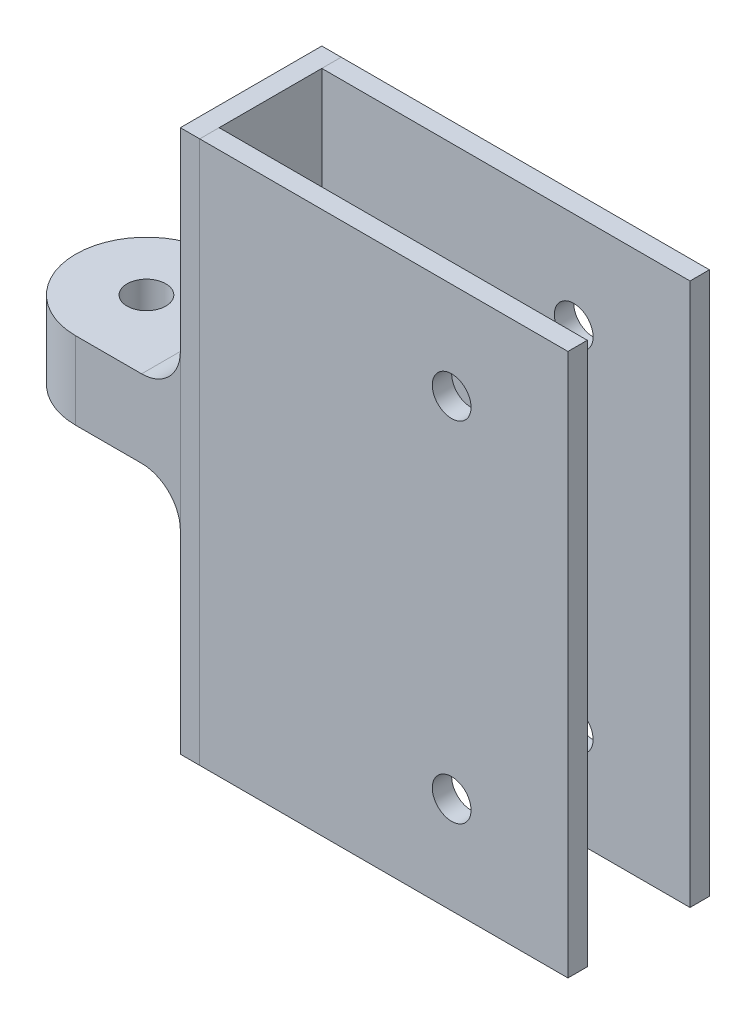
ISO-10303-21;
HEADER;
FILE_DESCRIPTION(('STEP AP214'),'2;1');
FILE_NAME('part.step','',(''),(''),'','','');
FILE_SCHEMA(('AUTOMOTIVE_DESIGN { 1 0 10303 214 1 1 1 1 }'));
ENDSEC;
DATA;
#1=APPLICATION_CONTEXT('core data for automotive mechanical design processes');
#2=APPLICATION_PROTOCOL_DEFINITION('international standard','automotive_design',2000,#1);
#3=PRODUCT_CONTEXT('',#1,'mechanical');
#4=PRODUCT('Part','Part','',(#3));
#5=PRODUCT_RELATED_PRODUCT_CATEGORY('part','',(#4));
#6=PRODUCT_DEFINITION_FORMATION('','',#4);
#7=PRODUCT_DEFINITION_CONTEXT('part definition',#1,'design');
#8=PRODUCT_DEFINITION('design','',#6,#7);
#9=PRODUCT_DEFINITION_SHAPE('','',#8);
#10=(LENGTH_UNIT() NAMED_UNIT(*) SI_UNIT(.MILLI.,.METRE.));
#11=(NAMED_UNIT(*) PLANE_ANGLE_UNIT() SI_UNIT($,.RADIAN.));
#12=(NAMED_UNIT(*) SI_UNIT($,.STERADIAN.) SOLID_ANGLE_UNIT());
#13=UNCERTAINTY_MEASURE_WITH_UNIT(LENGTH_MEASURE(1.E-05),#10,'distance_accuracy_value','');
#14=(GEOMETRIC_REPRESENTATION_CONTEXT(3) GLOBAL_UNCERTAINTY_ASSIGNED_CONTEXT((#13)) GLOBAL_UNIT_ASSIGNED_CONTEXT((#10,
#11,#12)) REPRESENTATION_CONTEXT('',''));
#15=CARTESIAN_POINT('',(0.,0.,0.));
#16=DIRECTION('',(0.,0.,1.));
#17=DIRECTION('',(1.,0.,0.));
#18=AXIS2_PLACEMENT_3D('',#15,#16,#17);
#19=CARTESIAN_POINT('',(5.,-60.01,-5.));
#20=DIRECTION('',(-1.,0.,0.));
#21=DIRECTION('',(0.,0.,1.));
#22=AXIS2_PLACEMENT_3D('',#19,#20,#21);
#23=PLANE('',#22);
#24=DIRECTION('',(0.,0.,-1.));
#25=VECTOR('',#24,1.);
#26=CARTESIAN_POINT('',(5.,-60.,0.));
#27=LINE('',#26,#25);
#28=CARTESIAN_POINT('',(5.,-60.,0.));
#29=VERTEX_POINT('',#28);
#30=CARTESIAN_POINT('',(4.99999999999999,-60.,-5.));
#31=VERTEX_POINT('',#30);
#32=EDGE_CURVE('E202',#29,#31,#27,.T.);
#33=ORIENTED_EDGE('',*,*,#32,.F.);
#34=DIRECTION('',(0.,1.,0.));
#35=VECTOR('',#34,1.);
#36=CARTESIAN_POINT('',(5.,20.,0.));
#37=LINE('',#36,#35);
#38=CARTESIAN_POINT('',(5.,80.,0.));
#39=VERTEX_POINT('',#38);
#40=EDGE_CURVE('E211',#29,#39,#37,.T.);
#41=ORIENTED_EDGE('',*,*,#40,.T.);
#42=DIRECTION('',(0.,0.,1.));
#43=VECTOR('',#42,1.);
#44=CARTESIAN_POINT('',(5.,80.,0.));
#45=LINE('',#44,#43);
#46=CARTESIAN_POINT('',(5.,80.,-5.));
#47=VERTEX_POINT('',#46);
#48=EDGE_CURVE('E208',#47,#39,#45,.T.);
#49=ORIENTED_EDGE('',*,*,#48,.F.);
#50=DIRECTION('',(0.,-1.,0.));
#51=VECTOR('',#50,1.);
#52=CARTESIAN_POINT('',(4.99999999999999,20.,-5.));
#53=LINE('',#52,#51);
#54=EDGE_CURVE('E196',#47,#31,#53,.T.);
#55=ORIENTED_EDGE('',*,*,#54,.T.);
#56=EDGE_LOOP('',(#33,#41,#49,#55));
#57=FACE_BOUND('',#56,.T.);
#58=ADVANCED_FACE('F149',(#57),#23,.T.);
#59=CARTESIAN_POINT('',(0.,20.,0.));
#60=DIRECTION('',(0.,0.,-1.));
#61=DIRECTION('',(-1.,0.,0.));
#62=AXIS2_PLACEMENT_3D('',#59,#60,#61);
#63=PLANE('',#62);
#64=CARTESIAN_POINT('',(70.,-35.,0.));
#65=DIRECTION('',(0.,0.,1.));
#66=DIRECTION('',(1.,0.,0.));
#67=AXIS2_PLACEMENT_3D('',#64,#65,#66);
#68=CIRCLE('',#67,4.99999999999999);
#69=CARTESIAN_POINT('',(75.,-35.,0.));
#70=VERTEX_POINT('',#69);
#71=EDGE_CURVE('E228',#70,#70,#68,.T.);
#72=ORIENTED_EDGE('',*,*,#71,.F.);
#73=EDGE_LOOP('',(#72));
#74=FACE_BOUND('',#73,.T.);
#75=CARTESIAN_POINT('',(70.,55.,0.));
#76=DIRECTION('',(0.,0.,1.));
#77=DIRECTION('',(1.,0.,0.));
#78=AXIS2_PLACEMENT_3D('',#75,#76,#77);
#79=CIRCLE('',#78,4.99999999999999);
#80=CARTESIAN_POINT('',(75.,55.,0.));
#81=VERTEX_POINT('',#80);
#82=EDGE_CURVE('E13',#81,#81,#79,.T.);
#83=ORIENTED_EDGE('',*,*,#82,.F.);
#84=EDGE_LOOP('',(#83));
#85=FACE_BOUND('',#84,.T.);
#86=ORIENTED_EDGE('',*,*,#40,.F.);
#87=DIRECTION('',(-1.,0.,0.));
#88=VECTOR('',#87,1.);
#89=CARTESIAN_POINT('',(0.,-60.,0.));
#90=LINE('',#89,#88);
#91=CARTESIAN_POINT('',(100.,-60.,0.));
#92=VERTEX_POINT('',#91);
#93=EDGE_CURVE('E153',#92,#29,#90,.T.);
#94=ORIENTED_EDGE('',*,*,#93,.F.);
#95=DIRECTION('',(0.,-1.,0.));
#96=VECTOR('',#95,1.);
#97=CARTESIAN_POINT('',(100.,20.,0.));
#98=LINE('',#97,#96);
#99=CARTESIAN_POINT('',(100.,80.,0.));
#100=VERTEX_POINT('',#99);
#101=EDGE_CURVE('E174',#100,#92,#98,.T.);
#102=ORIENTED_EDGE('',*,*,#101,.F.);
#103=DIRECTION('',(1.,0.,0.));
#104=VECTOR('',#103,1.);
#105=CARTESIAN_POINT('',(0.,80.,0.));
#106=LINE('',#105,#104);
#107=EDGE_CURVE('E215',#39,#100,#106,.T.);
#108=ORIENTED_EDGE('',*,*,#107,.F.);
#109=EDGE_LOOP('',(#86,#94,#102,#108));
#110=FACE_BOUND('',#109,.T.);
#111=ADVANCED_FACE('F151',(#74,#85,#110),#63,.F.);
#112=CARTESIAN_POINT('',(0.,80.,0.));
#113=DIRECTION('',(0.,1.,0.));
#114=DIRECTION('',(0.,0.,1.));
#115=AXIS2_PLACEMENT_3D('',#112,#113,#114);
#116=PLANE('',#115);
#117=DIRECTION('',(-1.,0.,0.));
#118=VECTOR('',#117,1.);
#119=CARTESIAN_POINT('',(0.,80.,-5.));
#120=LINE('',#119,#118);
#121=CARTESIAN_POINT('',(100.,80.,-4.99999999999998));
#122=VERTEX_POINT('',#121);
#123=EDGE_CURVE('E220',#122,#47,#120,.T.);
#124=ORIENTED_EDGE('',*,*,#123,.T.);
#125=ORIENTED_EDGE('',*,*,#48,.T.);
#126=ORIENTED_EDGE('',*,*,#107,.T.);
#127=DIRECTION('',(0.,0.,-1.));
#128=VECTOR('',#127,1.);
#129=CARTESIAN_POINT('',(100.,80.,-2.7755575615629E-13));
#130=LINE('',#129,#128);
#131=EDGE_CURVE('E216',#100,#122,#130,.T.);
#132=ORIENTED_EDGE('',*,*,#131,.T.);
#133=EDGE_LOOP('',(#124,#125,#126,#132));
#134=FACE_BOUND('',#133,.T.);
#135=ADVANCED_FACE('F230',(#134),#116,.T.);
#136=CARTESIAN_POINT('',(0.,-60.,0.));
#137=DIRECTION('',(0.,-1.,0.));
#138=DIRECTION('',(0.,0.,-1.));
#139=AXIS2_PLACEMENT_3D('',#136,#137,#138);
#140=PLANE('',#139);
#141=ORIENTED_EDGE('',*,*,#93,.T.);
#142=ORIENTED_EDGE('',*,*,#32,.T.);
#143=DIRECTION('',(1.,0.,0.));
#144=VECTOR('',#143,1.);
#145=CARTESIAN_POINT('',(0.,-60.,-5.));
#146=LINE('',#145,#144);
#147=CARTESIAN_POINT('',(100.,-60.,-4.99999999999998));
#148=VERTEX_POINT('',#147);
#149=EDGE_CURVE('E192',#31,#148,#146,.T.);
#150=ORIENTED_EDGE('',*,*,#149,.T.);
#151=DIRECTION('',(0.,0.,1.));
#152=VECTOR('',#151,1.);
#153=CARTESIAN_POINT('',(100.,-60.,-2.7755575615629E-13));
#154=LINE('',#153,#152);
#155=EDGE_CURVE('E199',#148,#92,#154,.T.);
#156=ORIENTED_EDGE('',*,*,#155,.T.);
#157=EDGE_LOOP('',(#141,#142,#150,#156));
#158=FACE_BOUND('',#157,.T.);
#159=ADVANCED_FACE('F203',(#158),#140,.T.);
#160=CARTESIAN_POINT('',(100.,20.,-2.7755575615629E-13));
#161=DIRECTION('',(-1.,0.,0.));
#162=DIRECTION('',(0.,0.,1.));
#163=AXIS2_PLACEMENT_3D('',#160,#161,#162);
#164=PLANE('',#163);
#165=ORIENTED_EDGE('',*,*,#101,.T.);
#166=ORIENTED_EDGE('',*,*,#155,.F.);
#167=DIRECTION('',(0.,-1.,0.));
#168=VECTOR('',#167,1.);
#169=CARTESIAN_POINT('',(100.,20.,-4.99999999999998));
#170=LINE('',#169,#168);
#171=EDGE_CURVE('E166',#122,#148,#170,.T.);
#172=ORIENTED_EDGE('',*,*,#171,.F.);
#173=ORIENTED_EDGE('',*,*,#131,.F.);
#174=EDGE_LOOP('',(#165,#166,#172,#173));
#175=FACE_BOUND('',#174,.T.);
#176=ADVANCED_FACE('F233',(#175),#164,.F.);
#177=CARTESIAN_POINT('',(0.,20.,-5.));
#178=DIRECTION('',(0.,0.,-1.));
#179=DIRECTION('',(-1.,0.,0.));
#180=AXIS2_PLACEMENT_3D('',#177,#178,#179);
#181=PLANE('',#180);
#182=CARTESIAN_POINT('',(70.,55.,-4.99999999999999));
#183=DIRECTION('',(0.,0.,-1.));
#184=DIRECTION('',(-1.,0.,0.));
#185=AXIS2_PLACEMENT_3D('',#182,#183,#184);
#186=CIRCLE('',#185,4.99999999999999);
#187=CARTESIAN_POINT('',(65.,55.,-4.99999999999999));
#188=VERTEX_POINT('',#187);
#189=EDGE_CURVE('E158',#188,#188,#186,.T.);
#190=ORIENTED_EDGE('',*,*,#189,.F.);
#191=EDGE_LOOP('',(#190));
#192=FACE_BOUND('',#191,.T.);
#193=CARTESIAN_POINT('',(70.,-35.,-4.99999999999999));
#194=DIRECTION('',(0.,0.,-1.));
#195=DIRECTION('',(-1.,0.,0.));
#196=AXIS2_PLACEMENT_3D('',#193,#194,#195);
#197=CIRCLE('',#196,4.99999999999999);
#198=CARTESIAN_POINT('',(65.,-35.,-4.99999999999999));
#199=VERTEX_POINT('',#198);
#200=EDGE_CURVE('E198',#199,#199,#197,.T.);
#201=ORIENTED_EDGE('',*,*,#200,.F.);
#202=EDGE_LOOP('',(#201));
#203=FACE_BOUND('',#202,.T.);
#204=ORIENTED_EDGE('',*,*,#171,.T.);
#205=ORIENTED_EDGE('',*,*,#149,.F.);
#206=ORIENTED_EDGE('',*,*,#54,.F.);
#207=ORIENTED_EDGE('',*,*,#123,.F.);
#208=EDGE_LOOP('',(#204,#205,#206,#207));
#209=FACE_BOUND('',#208,.T.);
#210=ADVANCED_FACE('F194',(#192,#203,#209),#181,.T.);
#211=CARTESIAN_POINT('',(70.,-35.,0.));
#212=DIRECTION('',(0.,0.,1.));
#213=DIRECTION('',(1.,0.,0.));
#214=AXIS2_PLACEMENT_3D('',#211,#212,#213);
#215=CYLINDRICAL_SURFACE('',#214,4.99999999999999);
#216=ORIENTED_EDGE('',*,*,#200,.T.);
#217=EDGE_LOOP('',(#216));
#218=FACE_BOUND('',#217,.T.);
#219=ORIENTED_EDGE('',*,*,#71,.T.);
#220=EDGE_LOOP('',(#219));
#221=FACE_BOUND('',#220,.T.);
#222=ADVANCED_FACE('F243',(#218,#221),#215,.F.);
#223=CARTESIAN_POINT('',(70.,55.,0.));
#224=DIRECTION('',(0.,0.,1.));
#225=DIRECTION('',(1.,0.,0.));
#226=AXIS2_PLACEMENT_3D('',#223,#224,#225);
#227=CYLINDRICAL_SURFACE('',#226,4.99999999999999);
#228=ORIENTED_EDGE('',*,*,#189,.T.);
#229=EDGE_LOOP('',(#228));
#230=FACE_BOUND('',#229,.T.);
#231=ORIENTED_EDGE('',*,*,#82,.T.);
#232=EDGE_LOOP('',(#231));
#233=FACE_BOUND('',#232,.T.);
#234=ADVANCED_FACE('F238',(#230,#233),#227,.F.);
#235=CLOSED_SHELL('',(#58,#111,#135,#159,#176,#210,#222,#234));
#236=MANIFOLD_SOLID_BREP('B2',#235);
#237=CARTESIAN_POINT('',(0.,-60.01,-36.5));
#238=DIRECTION('',(-1.,0.,0.));
#239=DIRECTION('',(0.,0.,1.));
#240=AXIS2_PLACEMENT_3D('',#237,#238,#239);
#241=PLANE('',#240);
#242=DIRECTION('',(0.,0.,1.));
#243=VECTOR('',#242,1.);
#244=CARTESIAN_POINT('',(0.,-10.,0.));
#245=LINE('',#244,#243);
#246=CARTESIAN_POINT('',(0.,-10.,0.));
#247=VERTEX_POINT('',#246);
#248=CARTESIAN_POINT('',(0.,-10.,-36.5));
#249=VERTEX_POINT('',#248);
#250=EDGE_CURVE('E414',#247,#249,#245,.F.);
#251=ORIENTED_EDGE('',*,*,#250,.T.);
#252=DIRECTION('',(0.,1.,0.));
#253=VECTOR('',#252,1.);
#254=CARTESIAN_POINT('',(0.,20.,-36.5));
#255=LINE('',#254,#253);
#256=CARTESIAN_POINT('',(0.,30.,-36.5));
#257=VERTEX_POINT('',#256);
#258=EDGE_CURVE('E470',#249,#257,#255,.T.);
#259=ORIENTED_EDGE('',*,*,#258,.T.);
#260=DIRECTION('',(0.,0.,-1.));
#261=VECTOR('',#260,1.);
#262=CARTESIAN_POINT('',(0.,30.,0.));
#263=LINE('',#262,#261);
#264=CARTESIAN_POINT('',(0.,30.,0.));
#265=VERTEX_POINT('',#264);
#266=EDGE_CURVE('E477',#257,#265,#263,.F.);
#267=ORIENTED_EDGE('',*,*,#266,.T.);
#268=DIRECTION('',(0.,1.,0.));
#269=VECTOR('',#268,1.);
#270=CARTESIAN_POINT('',(0.,20.,0.));
#271=LINE('',#270,#269);
#272=EDGE_CURVE('E476',#247,#265,#271,.T.);
#273=ORIENTED_EDGE('',*,*,#272,.F.);
#274=EDGE_LOOP('',(#251,#259,#267,#273));
#275=FACE_BOUND('',#274,.T.);
#276=ADVANCED_FACE('F410',(#275),#241,.F.);
#277=CARTESIAN_POINT('',(-27.,20.,-18.25));
#278=DIRECTION('',(0.,1.,0.));
#279=DIRECTION('',(0.,0.,1.));
#280=AXIS2_PLACEMENT_3D('',#277,#278,#279);
#281=CYLINDRICAL_SURFACE('',#280,5.);
#282=CARTESIAN_POINT('',(-27.,0.,-18.25));
#283=DIRECTION('',(0.,1.,0.));
#284=DIRECTION('',(0.,0.,1.));
#285=AXIS2_PLACEMENT_3D('',#282,#283,#284);
#286=CIRCLE('',#285,5.);
#287=CARTESIAN_POINT('',(-27.,0.,-13.25));
#288=VERTEX_POINT('',#287);
#289=EDGE_CURVE('E420',#288,#288,#286,.T.);
#290=ORIENTED_EDGE('',*,*,#289,.F.);
#291=EDGE_LOOP('',(#290));
#292=FACE_BOUND('',#291,.T.);
#293=CARTESIAN_POINT('',(-27.,20.,-18.25));
#294=DIRECTION('',(0.,1.,0.));
#295=DIRECTION('',(0.,0.,1.));
#296=AXIS2_PLACEMENT_3D('',#293,#294,#295);
#297=CIRCLE('',#296,5.);
#298=CARTESIAN_POINT('',(-27.,20.,-13.25));
#299=VERTEX_POINT('',#298);
#300=EDGE_CURVE('E147',#299,#299,#297,.T.);
#301=ORIENTED_EDGE('',*,*,#300,.T.);
#302=EDGE_LOOP('',(#301));
#303=FACE_BOUND('',#302,.T.);
#304=ADVANCED_FACE('F536',(#292,#303),#281,.F.);
#305=CARTESIAN_POINT('',(-27.,20.,-18.25));
#306=DIRECTION('',(0.,-1.,0.));
#307=DIRECTION('',(0.,0.,-1.));
#308=AXIS2_PLACEMENT_3D('',#305,#306,#307);
#309=CYLINDRICAL_SURFACE('',#308,18.25);
#310=CARTESIAN_POINT('',(-27.,0.,-18.25));
#311=DIRECTION('',(0.,1.,0.));
#312=DIRECTION('',(0.,0.,1.));
#313=AXIS2_PLACEMENT_3D('',#310,#311,#312);
#314=CIRCLE('',#313,18.25);
#315=CARTESIAN_POINT('',(-27.,0.,-36.5));
#316=VERTEX_POINT('',#315);
#317=CARTESIAN_POINT('',(-27.,0.,0.));
#318=VERTEX_POINT('',#317);
#319=EDGE_CURVE('E505',#316,#318,#314,.T.);
#320=ORIENTED_EDGE('',*,*,#319,.T.);
#321=DIRECTION('',(0.,-1.,0.));
#322=VECTOR('',#321,1.);
#323=CARTESIAN_POINT('',(-27.,20.,0.));
#324=LINE('',#323,#322);
#325=CARTESIAN_POINT('',(-27.,20.,0.));
#326=VERTEX_POINT('',#325);
#327=EDGE_CURVE('E498',#326,#318,#324,.T.);
#328=ORIENTED_EDGE('',*,*,#327,.F.);
#329=CARTESIAN_POINT('',(-27.,20.,-18.25));
#330=DIRECTION('',(0.,1.,0.));
#331=DIRECTION('',(0.,0.,1.));
#332=AXIS2_PLACEMENT_3D('',#329,#330,#331);
#333=CIRCLE('',#332,18.25);
#334=CARTESIAN_POINT('',(-27.,20.,-36.5));
#335=VERTEX_POINT('',#334);
#336=EDGE_CURVE('E439',#335,#326,#333,.T.);
#337=ORIENTED_EDGE('',*,*,#336,.F.);
#338=DIRECTION('',(0.,-1.,0.));
#339=VECTOR('',#338,1.);
#340=CARTESIAN_POINT('',(-27.,20.,-36.5));
#341=LINE('',#340,#339);
#342=EDGE_CURVE('E429',#335,#316,#341,.T.);
#343=ORIENTED_EDGE('',*,*,#342,.T.);
#344=EDGE_LOOP('',(#320,#328,#337,#343));
#345=FACE_BOUND('',#344,.T.);
#346=ADVANCED_FACE('F523',(#345),#309,.T.);
#347=CARTESIAN_POINT('',(0.,0.,0.));
#348=DIRECTION('',(0.,1.,0.));
#349=DIRECTION('',(0.,0.,1.));
#350=AXIS2_PLACEMENT_3D('',#347,#348,#349);
#351=PLANE('',#350);
#352=ORIENTED_EDGE('',*,*,#289,.T.);
#353=EDGE_LOOP('',(#352));
#354=FACE_BOUND('',#353,.T.);
#355=DIRECTION('',(1.,0.,0.));
#356=VECTOR('',#355,1.);
#357=CARTESIAN_POINT('',(0.,0.,-36.5));
#358=LINE('',#357,#356);
#359=CARTESIAN_POINT('',(-10.,0.,-36.5));
#360=VERTEX_POINT('',#359);
#361=EDGE_CURVE('E508',#316,#360,#358,.T.);
#362=ORIENTED_EDGE('',*,*,#361,.T.);
#363=DIRECTION('',(0.,0.,1.));
#364=VECTOR('',#363,1.);
#365=CARTESIAN_POINT('',(-10.,0.,0.));
#366=LINE('',#365,#364);
#367=CARTESIAN_POINT('',(-10.,0.,0.));
#368=VERTEX_POINT('',#367);
#369=EDGE_CURVE('E485',#360,#368,#366,.T.);
#370=ORIENTED_EDGE('',*,*,#369,.T.);
#371=DIRECTION('',(1.,0.,0.));
#372=VECTOR('',#371,1.);
#373=CARTESIAN_POINT('',(0.,0.,0.));
#374=LINE('',#373,#372);
#375=EDGE_CURVE('E502',#318,#368,#374,.T.);
#376=ORIENTED_EDGE('',*,*,#375,.F.);
#377=ORIENTED_EDGE('',*,*,#319,.F.);
#378=EDGE_LOOP('',(#362,#370,#376,#377));
#379=FACE_BOUND('',#378,.T.);
#380=ADVANCED_FACE('F526',(#354,#379),#351,.F.);
#381=CARTESIAN_POINT('',(0.,20.,0.));
#382=DIRECTION('',(0.,1.,0.));
#383=DIRECTION('',(0.,0.,1.));
#384=AXIS2_PLACEMENT_3D('',#381,#382,#383);
#385=PLANE('',#384);
#386=ORIENTED_EDGE('',*,*,#300,.F.);
#387=EDGE_LOOP('',(#386));
#388=FACE_BOUND('',#387,.T.);
#389=DIRECTION('',(1.,0.,0.));
#390=VECTOR('',#389,1.);
#391=CARTESIAN_POINT('',(0.,20.,0.));
#392=LINE('',#391,#390);
#393=CARTESIAN_POINT('',(-10.,20.,0.));
#394=VERTEX_POINT('',#393);
#395=EDGE_CURVE('E501',#326,#394,#392,.T.);
#396=ORIENTED_EDGE('',*,*,#395,.T.);
#397=DIRECTION('',(0.,0.,-1.));
#398=VECTOR('',#397,1.);
#399=CARTESIAN_POINT('',(-10.,20.,-36.5));
#400=LINE('',#399,#398);
#401=CARTESIAN_POINT('',(-10.,20.,-36.5));
#402=VERTEX_POINT('',#401);
#403=EDGE_CURVE('E488',#394,#402,#400,.T.);
#404=ORIENTED_EDGE('',*,*,#403,.T.);
#405=DIRECTION('',(1.,0.,0.));
#406=VECTOR('',#405,1.);
#407=CARTESIAN_POINT('',(0.,20.,-36.5));
#408=LINE('',#407,#406);
#409=EDGE_CURVE('E506',#335,#402,#408,.T.);
#410=ORIENTED_EDGE('',*,*,#409,.F.);
#411=ORIENTED_EDGE('',*,*,#336,.T.);
#412=EDGE_LOOP('',(#396,#404,#410,#411));
#413=FACE_BOUND('',#412,.T.);
#414=ADVANCED_FACE('F522',(#388,#413),#385,.T.);
#415=CARTESIAN_POINT('',(0.,20.,-36.5));
#416=DIRECTION('',(0.,0.,-1.));
#417=DIRECTION('',(-1.,0.,0.));
#418=AXIS2_PLACEMENT_3D('',#415,#416,#417);
#419=PLANE('',#418);
#420=ORIENTED_EDGE('',*,*,#258,.F.);
#421=CARTESIAN_POINT('',(-10.,-10.,-36.5));
#422=DIRECTION('',(0.,0.,-1.));
#423=DIRECTION('',(-1.,0.,0.));
#424=AXIS2_PLACEMENT_3D('',#421,#422,#423);
#425=CIRCLE('',#424,10.);
#426=EDGE_CURVE('E447',#249,#360,#425,.F.);
#427=ORIENTED_EDGE('',*,*,#426,.T.);
#428=ORIENTED_EDGE('',*,*,#361,.F.);
#429=ORIENTED_EDGE('',*,*,#342,.F.);
#430=ORIENTED_EDGE('',*,*,#409,.T.);
#431=CARTESIAN_POINT('',(-10.,30.,-36.5));
#432=DIRECTION('',(0.,0.,-1.));
#433=DIRECTION('',(-1.,0.,0.));
#434=AXIS2_PLACEMENT_3D('',#431,#432,#433);
#435=CIRCLE('',#434,10.);
#436=EDGE_CURVE('E473',#402,#257,#435,.F.);
#437=ORIENTED_EDGE('',*,*,#436,.T.);
#438=EDGE_LOOP('',(#420,#427,#428,#429,#430,#437));
#439=FACE_BOUND('',#438,.T.);
#440=ADVANCED_FACE('F412',(#439),#419,.T.);
#441=CARTESIAN_POINT('',(0.,20.,0.));
#442=DIRECTION('',(0.,0.,-1.));
#443=DIRECTION('',(-1.,0.,0.));
#444=AXIS2_PLACEMENT_3D('',#441,#442,#443);
#445=PLANE('',#444);
#446=CARTESIAN_POINT('',(-10.,-10.,0.));
#447=DIRECTION('',(0.,0.,-1.));
#448=DIRECTION('',(-1.,0.,0.));
#449=AXIS2_PLACEMENT_3D('',#446,#447,#448);
#450=CIRCLE('',#449,10.);
#451=EDGE_CURVE('E486',#368,#247,#450,.T.);
#452=ORIENTED_EDGE('',*,*,#451,.T.);
#453=ORIENTED_EDGE('',*,*,#272,.T.);
#454=CARTESIAN_POINT('',(-10.,30.,0.));
#455=DIRECTION('',(0.,0.,-1.));
#456=DIRECTION('',(-1.,0.,0.));
#457=AXIS2_PLACEMENT_3D('',#454,#455,#456);
#458=CIRCLE('',#457,10.);
#459=EDGE_CURVE('E490',#265,#394,#458,.T.);
#460=ORIENTED_EDGE('',*,*,#459,.T.);
#461=ORIENTED_EDGE('',*,*,#395,.F.);
#462=ORIENTED_EDGE('',*,*,#327,.T.);
#463=ORIENTED_EDGE('',*,*,#375,.T.);
#464=EDGE_LOOP('',(#452,#453,#460,#461,#462,#463));
#465=FACE_BOUND('',#464,.T.);
#466=ADVANCED_FACE('F521',(#465),#445,.F.);
#467=CARTESIAN_POINT('',(-10.,30.,0.));
#468=DIRECTION('',(0.,0.,1.));
#469=DIRECTION('',(1.,0.,0.));
#470=AXIS2_PLACEMENT_3D('',#467,#468,#469);
#471=CYLINDRICAL_SURFACE('',#470,10.);
#472=ORIENTED_EDGE('',*,*,#459,.F.);
#473=ORIENTED_EDGE('',*,*,#266,.F.);
#474=ORIENTED_EDGE('',*,*,#436,.F.);
#475=ORIENTED_EDGE('',*,*,#403,.F.);
#476=EDGE_LOOP('',(#472,#473,#474,#475));
#477=FACE_BOUND('',#476,.T.);
#478=ADVANCED_FACE('F518',(#477),#471,.F.);
#479=CARTESIAN_POINT('',(-10.,-10.,0.));
#480=DIRECTION('',(0.,0.,1.));
#481=DIRECTION('',(1.,0.,0.));
#482=AXIS2_PLACEMENT_3D('',#479,#480,#481);
#483=CYLINDRICAL_SURFACE('',#482,10.);
#484=ORIENTED_EDGE('',*,*,#426,.F.);
#485=ORIENTED_EDGE('',*,*,#250,.F.);
#486=ORIENTED_EDGE('',*,*,#451,.F.);
#487=ORIENTED_EDGE('',*,*,#369,.F.);
#488=EDGE_LOOP('',(#484,#485,#486,#487));
#489=FACE_BOUND('',#488,.T.);
#490=ADVANCED_FACE('F483',(#489),#483,.F.);
#491=CLOSED_SHELL('',(#276,#304,#346,#380,#414,#440,#466,#478,#490));
#492=MANIFOLD_SOLID_BREP('B7',#491);
#493=CARTESIAN_POINT('',(5.,-60.01,-31.5));
#494=DIRECTION('',(1.,0.,0.));
#495=DIRECTION('',(0.,0.,-1.));
#496=AXIS2_PLACEMENT_3D('',#493,#494,#495);
#497=PLANE('',#496);
#498=DIRECTION('',(0.,0.,1.));
#499=VECTOR('',#498,1.);
#500=CARTESIAN_POINT('',(4.99999999999995,-60.,0.));
#501=LINE('',#500,#499);
#502=CARTESIAN_POINT('',(5.,-60.,-36.5));
#503=VERTEX_POINT('',#502);
#504=CARTESIAN_POINT('',(4.99999999999999,-60.,-31.5));
#505=VERTEX_POINT('',#504);
#506=EDGE_CURVE('E743',#503,#505,#501,.T.);
#507=ORIENTED_EDGE('',*,*,#506,.T.);
#508=DIRECTION('',(0.,-1.,0.));
#509=VECTOR('',#508,1.);
#510=CARTESIAN_POINT('',(4.99999999999999,20.,-31.5));
#511=LINE('',#510,#509);
#512=CARTESIAN_POINT('',(5.,80.,-31.5));
#513=VERTEX_POINT('',#512);
#514=EDGE_CURVE('E771',#513,#505,#511,.T.);
#515=ORIENTED_EDGE('',*,*,#514,.F.);
#516=DIRECTION('',(0.,0.,-1.));
#517=VECTOR('',#516,1.);
#518=CARTESIAN_POINT('',(4.99999999999995,80.,0.));
#519=LINE('',#518,#517);
#520=CARTESIAN_POINT('',(5.,80.,-36.5));
#521=VERTEX_POINT('',#520);
#522=EDGE_CURVE('E745',#513,#521,#519,.T.);
#523=ORIENTED_EDGE('',*,*,#522,.T.);
#524=DIRECTION('',(0.,-1.,0.));
#525=VECTOR('',#524,1.);
#526=CARTESIAN_POINT('',(5.,20.,-36.5));
#527=LINE('',#526,#525);
#528=EDGE_CURVE('E741',#521,#503,#527,.T.);
#529=ORIENTED_EDGE('',*,*,#528,.T.);
#530=EDGE_LOOP('',(#507,#515,#523,#529));
#531=FACE_BOUND('',#530,.T.);
#532=ADVANCED_FACE('F697',(#531),#497,.F.);
#533=CARTESIAN_POINT('',(70.,-35.,0.));
#534=DIRECTION('',(0.,0.,1.));
#535=DIRECTION('',(1.,0.,0.));
#536=AXIS2_PLACEMENT_3D('',#533,#534,#535);
#537=CYLINDRICAL_SURFACE('',#536,4.99999999999999);
#538=CARTESIAN_POINT('',(70.,-35.,-36.5));
#539=DIRECTION('',(0.,0.,1.));
#540=DIRECTION('',(1.,0.,0.));
#541=AXIS2_PLACEMENT_3D('',#538,#539,#540);
#542=CIRCLE('',#541,4.99999999999999);
#543=CARTESIAN_POINT('',(75.,-35.,-36.5));
#544=VERTEX_POINT('',#543);
#545=EDGE_CURVE('E760',#544,#544,#542,.T.);
#546=ORIENTED_EDGE('',*,*,#545,.F.);
#547=EDGE_LOOP('',(#546));
#548=FACE_BOUND('',#547,.T.);
#549=CARTESIAN_POINT('',(70.,-35.,-31.5));
#550=DIRECTION('',(0.,0.,-1.));
#551=DIRECTION('',(-1.,0.,0.));
#552=AXIS2_PLACEMENT_3D('',#549,#550,#551);
#553=CIRCLE('',#552,4.99999999999999);
#554=CARTESIAN_POINT('',(65.,-35.,-31.5));
#555=VERTEX_POINT('',#554);
#556=EDGE_CURVE('E757',#555,#555,#553,.T.);
#557=ORIENTED_EDGE('',*,*,#556,.F.);
#558=EDGE_LOOP('',(#557));
#559=FACE_BOUND('',#558,.T.);
#560=ADVANCED_FACE('F795',(#548,#559),#537,.F.);
#561=CARTESIAN_POINT('',(70.,55.,0.));
#562=DIRECTION('',(0.,0.,1.));
#563=DIRECTION('',(1.,0.,0.));
#564=AXIS2_PLACEMENT_3D('',#561,#562,#563);
#565=CYLINDRICAL_SURFACE('',#564,4.99999999999999);
#566=CARTESIAN_POINT('',(70.,55.,-36.5));
#567=DIRECTION('',(0.,0.,1.));
#568=DIRECTION('',(1.,0.,0.));
#569=AXIS2_PLACEMENT_3D('',#566,#567,#568);
#570=CIRCLE('',#569,4.99999999999999);
#571=CARTESIAN_POINT('',(75.,55.,-36.5));
#572=VERTEX_POINT('',#571);
#573=EDGE_CURVE('E408',#572,#572,#570,.T.);
#574=ORIENTED_EDGE('',*,*,#573,.F.);
#575=EDGE_LOOP('',(#574));
#576=FACE_BOUND('',#575,.T.);
#577=CARTESIAN_POINT('',(70.,55.,-31.5));
#578=DIRECTION('',(0.,0.,-1.));
#579=DIRECTION('',(-1.,0.,0.));
#580=AXIS2_PLACEMENT_3D('',#577,#578,#579);
#581=CIRCLE('',#580,4.99999999999999);
#582=CARTESIAN_POINT('',(65.,55.,-31.5));
#583=VERTEX_POINT('',#582);
#584=EDGE_CURVE('E706',#583,#583,#581,.T.);
#585=ORIENTED_EDGE('',*,*,#584,.F.);
#586=EDGE_LOOP('',(#585));
#587=FACE_BOUND('',#586,.T.);
#588=ADVANCED_FACE('F699',(#576,#587),#565,.F.);
#589=CARTESIAN_POINT('',(0.,20.,-31.5));
#590=DIRECTION('',(0.,0.,-1.));
#591=DIRECTION('',(-1.,0.,0.));
#592=AXIS2_PLACEMENT_3D('',#589,#590,#591);
#593=PLANE('',#592);
#594=ORIENTED_EDGE('',*,*,#584,.T.);
#595=EDGE_LOOP('',(#594));
#596=FACE_BOUND('',#595,.T.);
#597=ORIENTED_EDGE('',*,*,#556,.T.);
#598=EDGE_LOOP('',(#597));
#599=FACE_BOUND('',#598,.T.);
#600=ORIENTED_EDGE('',*,*,#514,.T.);
#601=DIRECTION('',(-1.,0.,0.));
#602=VECTOR('',#601,1.);
#603=CARTESIAN_POINT('',(0.,-60.,-31.5));
#604=LINE('',#603,#602);
#605=CARTESIAN_POINT('',(100.,-60.,-31.5));
#606=VERTEX_POINT('',#605);
#607=EDGE_CURVE('E753',#606,#505,#604,.T.);
#608=ORIENTED_EDGE('',*,*,#607,.F.);
#609=DIRECTION('',(0.,-1.,0.));
#610=VECTOR('',#609,1.);
#611=CARTESIAN_POINT('',(100.,20.,-31.5));
#612=LINE('',#611,#610);
#613=CARTESIAN_POINT('',(100.,80.,-31.5));
#614=VERTEX_POINT('',#613);
#615=EDGE_CURVE('E721',#614,#606,#612,.T.);
#616=ORIENTED_EDGE('',*,*,#615,.F.);
#617=DIRECTION('',(1.,0.,0.));
#618=VECTOR('',#617,1.);
#619=CARTESIAN_POINT('',(0.,80.,-31.5));
#620=LINE('',#619,#618);
#621=EDGE_CURVE('E773',#513,#614,#620,.T.);
#622=ORIENTED_EDGE('',*,*,#621,.F.);
#623=EDGE_LOOP('',(#600,#608,#616,#622));
#624=FACE_BOUND('',#623,.T.);
#625=ADVANCED_FACE('F785',(#596,#599,#624),#593,.F.);
#626=CARTESIAN_POINT('',(99.9999999999999,20.,2.77555756156289E-13));
#627=DIRECTION('',(1.,0.,0.));
#628=DIRECTION('',(0.,0.,-1.));
#629=AXIS2_PLACEMENT_3D('',#626,#627,#628);
#630=PLANE('',#629);
#631=ORIENTED_EDGE('',*,*,#615,.T.);
#632=DIRECTION('',(0.,0.,1.));
#633=VECTOR('',#632,1.);
#634=CARTESIAN_POINT('',(99.9999999999999,-60.,2.77555756156289E-13));
#635=LINE('',#634,#633);
#636=CARTESIAN_POINT('',(100.,-60.,-36.5));
#637=VERTEX_POINT('',#636);
#638=EDGE_CURVE('E758',#637,#606,#635,.T.);
#639=ORIENTED_EDGE('',*,*,#638,.F.);
#640=DIRECTION('',(0.,-1.,0.));
#641=VECTOR('',#640,1.);
#642=CARTESIAN_POINT('',(100.,20.,-36.5));
#643=LINE('',#642,#641);
#644=CARTESIAN_POINT('',(100.,80.,-36.5));
#645=VERTEX_POINT('',#644);
#646=EDGE_CURVE('E749',#645,#637,#643,.T.);
#647=ORIENTED_EDGE('',*,*,#646,.F.);
#648=DIRECTION('',(0.,0.,-1.));
#649=VECTOR('',#648,1.);
#650=CARTESIAN_POINT('',(99.9999999999999,80.,2.77555756156289E-13));
#651=LINE('',#650,#649);
#652=EDGE_CURVE('E777',#614,#645,#651,.T.);
#653=ORIENTED_EDGE('',*,*,#652,.F.);
#654=EDGE_LOOP('',(#631,#639,#647,#653));
#655=FACE_BOUND('',#654,.T.);
#656=ADVANCED_FACE('F783',(#655),#630,.T.);
#657=CARTESIAN_POINT('',(0.,20.,-36.5));
#658=DIRECTION('',(0.,0.,-1.));
#659=DIRECTION('',(-1.,0.,0.));
#660=AXIS2_PLACEMENT_3D('',#657,#658,#659);
#661=PLANE('',#660);
#662=ORIENTED_EDGE('',*,*,#528,.F.);
#663=DIRECTION('',(-1.,0.,0.));
#664=VECTOR('',#663,1.);
#665=CARTESIAN_POINT('',(0.,80.,-36.5));
#666=LINE('',#665,#664);
#667=EDGE_CURVE('E763',#645,#521,#666,.T.);
#668=ORIENTED_EDGE('',*,*,#667,.F.);
#669=ORIENTED_EDGE('',*,*,#646,.T.);
#670=DIRECTION('',(1.,0.,0.));
#671=VECTOR('',#670,1.);
#672=CARTESIAN_POINT('',(0.,-60.,-36.5));
#673=LINE('',#672,#671);
#674=EDGE_CURVE('E701',#503,#637,#673,.T.);
#675=ORIENTED_EDGE('',*,*,#674,.F.);
#676=EDGE_LOOP('',(#662,#668,#669,#675));
#677=FACE_BOUND('',#676,.T.);
#678=ORIENTED_EDGE('',*,*,#573,.T.);
#679=EDGE_LOOP('',(#678));
#680=FACE_BOUND('',#679,.T.);
#681=ORIENTED_EDGE('',*,*,#545,.T.);
#682=EDGE_LOOP('',(#681));
#683=FACE_BOUND('',#682,.T.);
#684=ADVANCED_FACE('F755',(#677,#680,#683),#661,.T.);
#685=CARTESIAN_POINT('',(0.,-60.,0.));
#686=DIRECTION('',(0.,-1.,0.));
#687=DIRECTION('',(0.,0.,-1.));
#688=AXIS2_PLACEMENT_3D('',#685,#686,#687);
#689=PLANE('',#688);
#690=ORIENTED_EDGE('',*,*,#506,.F.);
#691=ORIENTED_EDGE('',*,*,#674,.T.);
#692=ORIENTED_EDGE('',*,*,#638,.T.);
#693=ORIENTED_EDGE('',*,*,#607,.T.);
#694=EDGE_LOOP('',(#690,#691,#692,#693));
#695=FACE_BOUND('',#694,.T.);
#696=ADVANCED_FACE('F751',(#695),#689,.T.);
#697=CARTESIAN_POINT('',(0.,80.,0.));
#698=DIRECTION('',(0.,1.,0.));
#699=DIRECTION('',(0.,0.,1.));
#700=AXIS2_PLACEMENT_3D('',#697,#698,#699);
#701=PLANE('',#700);
#702=ORIENTED_EDGE('',*,*,#522,.F.);
#703=ORIENTED_EDGE('',*,*,#621,.T.);
#704=ORIENTED_EDGE('',*,*,#652,.T.);
#705=ORIENTED_EDGE('',*,*,#667,.T.);
#706=EDGE_LOOP('',(#702,#703,#704,#705));
#707=FACE_BOUND('',#706,.T.);
#708=ADVANCED_FACE('F782',(#707),#701,.T.);
#709=CLOSED_SHELL('',(#532,#560,#588,#625,#656,#684,#696,#708));
#710=MANIFOLD_SOLID_BREP('B141',#709);
#711=CARTESIAN_POINT('',(0.,80.,0.));
#712=DIRECTION('',(0.,1.,0.));
#713=DIRECTION('',(0.,0.,1.));
#714=AXIS2_PLACEMENT_3D('',#711,#712,#713);
#715=PLANE('',#714);
#716=DIRECTION('',(1.,0.,0.));
#717=VECTOR('',#716,1.);
#718=CARTESIAN_POINT('',(0.,80.,0.));
#719=LINE('',#718,#717);
#720=CARTESIAN_POINT('',(0.,80.,0.));
#721=VERTEX_POINT('',#720);
#722=CARTESIAN_POINT('',(5.,80.,0.));
#723=VERTEX_POINT('',#722);
#724=EDGE_CURVE('E1014',#721,#723,#719,.T.);
#725=ORIENTED_EDGE('',*,*,#724,.T.);
#726=DIRECTION('',(0.,0.,-1.));
#727=VECTOR('',#726,1.);
#728=CARTESIAN_POINT('',(5.,80.,0.));
#729=LINE('',#728,#727);
#730=CARTESIAN_POINT('',(5.,80.,-36.5));
#731=VERTEX_POINT('',#730);
#732=EDGE_CURVE('E970',#723,#731,#729,.T.);
#733=ORIENTED_EDGE('',*,*,#732,.T.);
#734=DIRECTION('',(-1.,0.,0.));
#735=VECTOR('',#734,1.);
#736=CARTESIAN_POINT('',(0.,80.,-36.5));
#737=LINE('',#736,#735);
#738=CARTESIAN_POINT('',(0.,80.,-36.5));
#739=VERTEX_POINT('',#738);
#740=EDGE_CURVE('E1011',#731,#739,#737,.T.);
#741=ORIENTED_EDGE('',*,*,#740,.T.);
#742=DIRECTION('',(0.,0.,-1.));
#743=VECTOR('',#742,1.);
#744=CARTESIAN_POINT('',(0.,80.,0.));
#745=LINE('',#744,#743);
#746=EDGE_CURVE('E997',#721,#739,#745,.T.);
#747=ORIENTED_EDGE('',*,*,#746,.F.);
#748=EDGE_LOOP('',(#725,#733,#741,#747));
#749=FACE_BOUND('',#748,.T.);
#750=ADVANCED_FACE('F948',(#749),#715,.T.);
#751=CARTESIAN_POINT('',(4.99999999999999,20.,0.));
#752=DIRECTION('',(-1.,0.,0.));
#753=DIRECTION('',(0.,0.,1.));
#754=AXIS2_PLACEMENT_3D('',#751,#752,#753);
#755=PLANE('',#754);
#756=ORIENTED_EDGE('',*,*,#732,.F.);
#757=DIRECTION('',(0.,1.,0.));
#758=VECTOR('',#757,1.);
#759=CARTESIAN_POINT('',(5.,20.,0.));
#760=LINE('',#759,#758);
#761=CARTESIAN_POINT('',(5.,-60.,0.));
#762=VERTEX_POINT('',#761);
#763=EDGE_CURVE('E956',#762,#723,#760,.T.);
#764=ORIENTED_EDGE('',*,*,#763,.F.);
#765=DIRECTION('',(0.,0.,1.));
#766=VECTOR('',#765,1.);
#767=CARTESIAN_POINT('',(4.99999999999999,-60.,0.));
#768=LINE('',#767,#766);
#769=CARTESIAN_POINT('',(5.,-60.,-36.5));
#770=VERTEX_POINT('',#769);
#771=EDGE_CURVE('E963',#770,#762,#768,.T.);
#772=ORIENTED_EDGE('',*,*,#771,.F.);
#773=DIRECTION('',(0.,-1.,0.));
#774=VECTOR('',#773,1.);
#775=CARTESIAN_POINT('',(5.,20.,-36.5));
#776=LINE('',#775,#774);
#777=EDGE_CURVE('E695',#731,#770,#776,.T.);
#778=ORIENTED_EDGE('',*,*,#777,.F.);
#779=EDGE_LOOP('',(#756,#764,#772,#778));
#780=FACE_BOUND('',#779,.T.);
#781=ADVANCED_FACE('F1022',(#780),#755,.F.);
#782=CARTESIAN_POINT('',(0.,20.,-36.5));
#783=DIRECTION('',(0.,0.,-1.));
#784=DIRECTION('',(-1.,0.,0.));
#785=AXIS2_PLACEMENT_3D('',#782,#783,#784);
#786=PLANE('',#785);
#787=DIRECTION('',(1.,0.,0.));
#788=VECTOR('',#787,1.);
#789=CARTESIAN_POINT('',(0.,-60.,-36.5));
#790=LINE('',#789,#788);
#791=CARTESIAN_POINT('',(0.,-60.,-36.5));
#792=VERTEX_POINT('',#791);
#793=EDGE_CURVE('E1002',#792,#770,#790,.T.);
#794=ORIENTED_EDGE('',*,*,#793,.F.);
#795=DIRECTION('',(0.,-1.,0.));
#796=VECTOR('',#795,1.);
#797=CARTESIAN_POINT('',(0.,80.,-36.5));
#798=LINE('',#797,#796);
#799=EDGE_CURVE('E991',#739,#792,#798,.T.);
#800=ORIENTED_EDGE('',*,*,#799,.F.);
#801=ORIENTED_EDGE('',*,*,#740,.F.);
#802=ORIENTED_EDGE('',*,*,#777,.T.);
#803=EDGE_LOOP('',(#794,#800,#801,#802));
#804=FACE_BOUND('',#803,.T.);
#805=ADVANCED_FACE('F950',(#804),#786,.T.);
#806=CARTESIAN_POINT('',(0.,20.,0.));
#807=DIRECTION('',(0.,0.,-1.));
#808=DIRECTION('',(-1.,0.,0.));
#809=AXIS2_PLACEMENT_3D('',#806,#807,#808);
#810=PLANE('',#809);
#811=DIRECTION('',(0.,-1.,0.));
#812=VECTOR('',#811,1.);
#813=CARTESIAN_POINT('',(0.,80.,0.));
#814=LINE('',#813,#812);
#815=CARTESIAN_POINT('',(0.,-60.,0.));
#816=VERTEX_POINT('',#815);
#817=EDGE_CURVE('E1000',#721,#816,#814,.T.);
#818=ORIENTED_EDGE('',*,*,#817,.T.);
#819=DIRECTION('',(-1.,0.,0.));
#820=VECTOR('',#819,1.);
#821=CARTESIAN_POINT('',(0.,-60.,0.));
#822=LINE('',#821,#820);
#823=EDGE_CURVE('E1006',#762,#816,#822,.T.);
#824=ORIENTED_EDGE('',*,*,#823,.F.);
#825=ORIENTED_EDGE('',*,*,#763,.T.);
#826=ORIENTED_EDGE('',*,*,#724,.F.);
#827=EDGE_LOOP('',(#818,#824,#825,#826));
#828=FACE_BOUND('',#827,.T.);
#829=ADVANCED_FACE('F1020',(#828),#810,.F.);
#830=CARTESIAN_POINT('',(0.,-60.,0.));
#831=DIRECTION('',(0.,-1.,0.));
#832=DIRECTION('',(0.,0.,-1.));
#833=AXIS2_PLACEMENT_3D('',#830,#831,#832);
#834=PLANE('',#833);
#835=ORIENTED_EDGE('',*,*,#771,.T.);
#836=ORIENTED_EDGE('',*,*,#823,.T.);
#837=DIRECTION('',(0.,0.,1.));
#838=VECTOR('',#837,1.);
#839=CARTESIAN_POINT('',(0.,-60.,0.));
#840=LINE('',#839,#838);
#841=EDGE_CURVE('E995',#792,#816,#840,.T.);
#842=ORIENTED_EDGE('',*,*,#841,.F.);
#843=ORIENTED_EDGE('',*,*,#793,.T.);
#844=EDGE_LOOP('',(#835,#836,#842,#843));
#845=FACE_BOUND('',#844,.T.);
#846=ADVANCED_FACE('F1004',(#845),#834,.T.);
#847=CARTESIAN_POINT('',(0.,80.,0.));
#848=DIRECTION('',(-1.,0.,0.));
#849=DIRECTION('',(0.,0.,1.));
#850=AXIS2_PLACEMENT_3D('',#847,#848,#849);
#851=PLANE('',#850);
#852=ORIENTED_EDGE('',*,*,#799,.T.);
#853=ORIENTED_EDGE('',*,*,#841,.T.);
#854=ORIENTED_EDGE('',*,*,#817,.F.);
#855=ORIENTED_EDGE('',*,*,#746,.T.);
#856=EDGE_LOOP('',(#852,#853,#854,#855));
#857=FACE_BOUND('',#856,.T.);
#858=ADVANCED_FACE('F993',(#857),#851,.T.);
#859=CLOSED_SHELL('',(#750,#781,#805,#829,#846,#858));
#860=MANIFOLD_SOLID_BREP('B402',#859);
#861=ADVANCED_BREP_SHAPE_REPRESENTATION('',(#18,#236,#492,#710,#860),#14);
#862=SHAPE_DEFINITION_REPRESENTATION(#9,#861);
ENDSEC;
END-ISO-10303-21;
